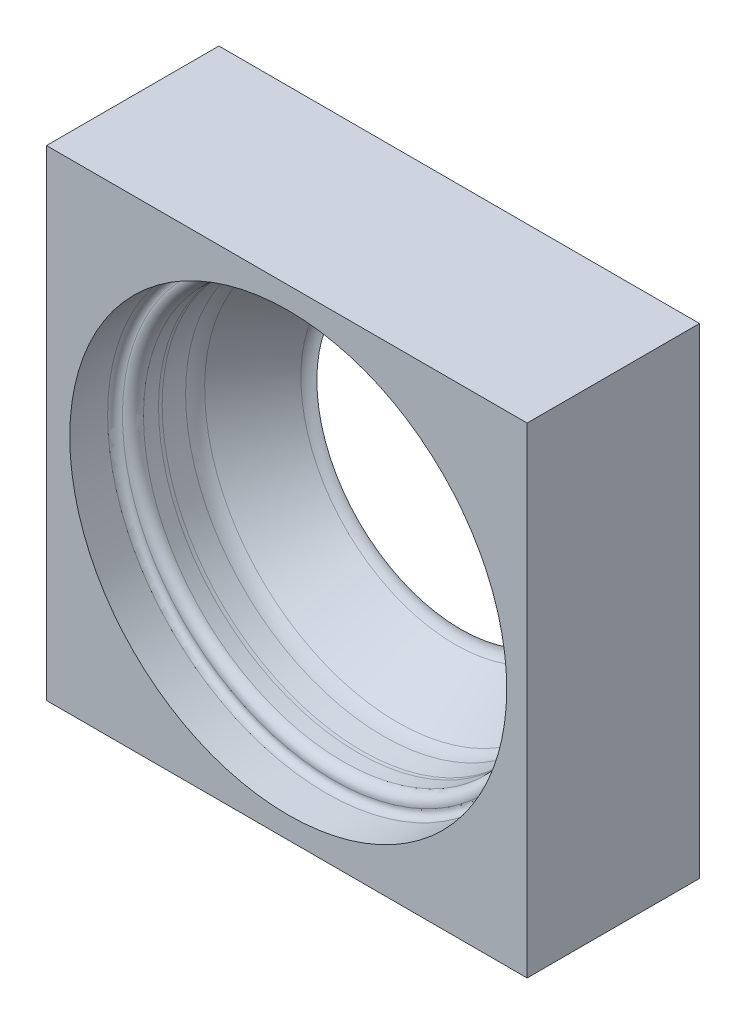
ISO-10303-21;
HEADER;
FILE_DESCRIPTION(('STEP AP214'),'2;1');
FILE_NAME('part.step','',(''),(''),'','','');
FILE_SCHEMA(('AUTOMOTIVE_DESIGN { 1 0 10303 214 1 1 1 1 }'));
ENDSEC;
DATA;
#1=APPLICATION_CONTEXT('core data for automotive mechanical design processes');
#2=APPLICATION_PROTOCOL_DEFINITION('international standard','automotive_design',2000,#1);
#3=PRODUCT_CONTEXT('',#1,'mechanical');
#4=PRODUCT('Part','Part','',(#3));
#5=PRODUCT_RELATED_PRODUCT_CATEGORY('part','',(#4));
#6=PRODUCT_DEFINITION_FORMATION('','',#4);
#7=PRODUCT_DEFINITION_CONTEXT('part definition',#1,'design');
#8=PRODUCT_DEFINITION('design','',#6,#7);
#9=PRODUCT_DEFINITION_SHAPE('','',#8);
#10=(LENGTH_UNIT() NAMED_UNIT(*) SI_UNIT(.MILLI.,.METRE.));
#11=(NAMED_UNIT(*) PLANE_ANGLE_UNIT() SI_UNIT($,.RADIAN.));
#12=(NAMED_UNIT(*) SI_UNIT($,.STERADIAN.) SOLID_ANGLE_UNIT());
#13=UNCERTAINTY_MEASURE_WITH_UNIT(LENGTH_MEASURE(1.E-05),#10,'distance_accuracy_value','');
#14=(GEOMETRIC_REPRESENTATION_CONTEXT(3) GLOBAL_UNCERTAINTY_ASSIGNED_CONTEXT((#13)) GLOBAL_UNIT_ASSIGNED_CONTEXT((#10,
#11,#12)) REPRESENTATION_CONTEXT('',''));
#15=CARTESIAN_POINT('',(0.,0.,0.));
#16=DIRECTION('',(0.,0.,1.));
#17=DIRECTION('',(1.,0.,0.));
#18=AXIS2_PLACEMENT_3D('',#15,#16,#17);
#19=CARTESIAN_POINT('',(0.,-4.61267334725164E-13,127.132943369893));
#20=DIRECTION('',(0.,0.,-1.));
#21=DIRECTION('',(0.,1.,0.));
#22=AXIS2_PLACEMENT_3D('',#19,#20,#21);
#23=PLANE('',#22);
#24=DIRECTION('',(-1.,0.,0.));
#25=VECTOR('',#24,1.);
#26=CARTESIAN_POINT('',(152.4,-152.4,127.132943369892));
#27=LINE('',#26,#25);
#28=CARTESIAN_POINT('',(152.4,-152.4,127.132943369893));
#29=VERTEX_POINT('',#28);
#30=CARTESIAN_POINT('',(-152.4,-152.4,127.132943369892));
#31=VERTEX_POINT('',#30);
#32=EDGE_CURVE('E134',#29,#31,#27,.T.);
#33=ORIENTED_EDGE('',*,*,#32,.T.);
#34=DIRECTION('',(0.,1.,0.));
#35=VECTOR('',#34,1.);
#36=CARTESIAN_POINT('',(-152.4,152.4,127.132943369893));
#37=LINE('',#36,#35);
#38=CARTESIAN_POINT('',(-152.4,152.4,127.132943369893));
#39=VERTEX_POINT('',#38);
#40=EDGE_CURVE('E132',#31,#39,#37,.T.);
#41=ORIENTED_EDGE('',*,*,#40,.T.);
#42=DIRECTION('',(1.,0.,0.));
#43=VECTOR('',#42,1.);
#44=CARTESIAN_POINT('',(152.4,152.4,127.132943369893));
#45=LINE('',#44,#43);
#46=CARTESIAN_POINT('',(152.4,152.4,127.132943369893));
#47=VERTEX_POINT('',#46);
#48=EDGE_CURVE('E87',#39,#47,#45,.T.);
#49=ORIENTED_EDGE('',*,*,#48,.T.);
#50=DIRECTION('',(0.,-1.,0.));
#51=VECTOR('',#50,1.);
#52=CARTESIAN_POINT('',(152.4,152.4,127.132943369893));
#53=LINE('',#52,#51);
#54=EDGE_CURVE('E137',#47,#29,#53,.T.);
#55=ORIENTED_EDGE('',*,*,#54,.T.);
#56=EDGE_LOOP('',(#33,#41,#49,#55));
#57=FACE_BOUND('',#56,.T.);
#58=CARTESIAN_POINT('',(0.90869526163995,-0.0776127525782167,127.132943369893));
#59=DIRECTION('',(0.,0.,1.));
#60=DIRECTION('',(0.,-1.,0.));
#61=AXIS2_PLACEMENT_3D('',#58,#59,#60);
#62=CIRCLE('',#61,91.1860000000005);
#63=CARTESIAN_POINT('',(0.90869526163995,-91.2636127525787,127.132943369892));
#64=VERTEX_POINT('',#63);
#65=EDGE_CURVE('E11',#64,#64,#62,.T.);
#66=ORIENTED_EDGE('',*,*,#65,.T.);
#67=EDGE_LOOP('',(#66));
#68=FACE_BOUND('',#67,.T.);
#69=ADVANCED_FACE('F39',(#57,#68),#23,.T.);
#70=CARTESIAN_POINT('',(0.90869526163995,-0.0776127525783632,169.085651996013));
#71=DIRECTION('',(0.,0.,1.));
#72=DIRECTION('',(0.,-1.,0.));
#73=AXIS2_PLACEMENT_3D('',#70,#71,#72);
#74=CYLINDRICAL_SURFACE('',#73,138.555289406168);
#75=CARTESIAN_POINT('',(0.90869526163995,-0.0776127525785146,212.450968055006));
#76=DIRECTION('',(0.,0.,1.));
#77=DIRECTION('',(0.,-1.,0.));
#78=AXIS2_PLACEMENT_3D('',#75,#76,#77);
#79=CIRCLE('',#78,138.555289406168);
#80=CARTESIAN_POINT('',(0.90869526163995,-138.632902158747,212.450968055005));
#81=VERTEX_POINT('',#80);
#82=EDGE_CURVE('E90',#81,#81,#79,.T.);
#83=ORIENTED_EDGE('',*,*,#82,.F.);
#84=EDGE_LOOP('',(#83));
#85=FACE_BOUND('',#84,.T.);
#86=CARTESIAN_POINT('',(0.90869526163995,-0.0776127525785565,236.450968055006));
#87=DIRECTION('',(0.,0.,1.));
#88=DIRECTION('',(1.,0.,0.));
#89=AXIS2_PLACEMENT_3D('',#86,#87,#88);
#90=CIRCLE('',#89,138.555289406168);
#91=CARTESIAN_POINT('',(139.463984667808,-0.0776127525785565,236.450968055006));
#92=VERTEX_POINT('',#91);
#93=EDGE_CURVE('E103',#92,#92,#90,.T.);
#94=ORIENTED_EDGE('',*,*,#93,.T.);
#95=EDGE_LOOP('',(#94));
#96=FACE_BOUND('',#95,.T.);
#97=ADVANCED_FACE('F155',(#85,#96),#74,.F.);
#98=CARTESIAN_POINT('',(0.90869526163995,-0.0776127525785141,212.327662527832));
#99=DIRECTION('',(0.,0.,1.));
#100=DIRECTION('',(0.,-1.,0.));
#101=AXIS2_PLACEMENT_3D('',#98,#99,#100);
#102=TOROIDAL_SURFACE('',#101,134.112,4.44499999999991);
#103=CARTESIAN_POINT('',(0.90869526163995,-0.0776127525784987,207.904943369893));
#104=DIRECTION('',(0.,0.,1.));
#105=DIRECTION('',(0.,-1.,0.));
#106=AXIS2_PLACEMENT_3D('',#103,#104,#105);
#107=CIRCLE('',#106,133.667500000001);
#108=CARTESIAN_POINT('',(0.90869526163995,-133.745112752579,207.904943369892));
#109=VERTEX_POINT('',#108);
#110=EDGE_CURVE('E112',#109,#109,#107,.T.);
#111=ORIENTED_EDGE('',*,*,#110,.F.);
#112=EDGE_LOOP('',(#111));
#113=FACE_BOUND('',#112,.T.);
#114=ORIENTED_EDGE('',*,*,#82,.T.);
#115=EDGE_LOOP('',(#114));
#116=FACE_BOUND('',#115,.T.);
#117=ADVANCED_FACE('F157',(#113,#116),#102,.F.);
#118=CARTESIAN_POINT('',(0.90869526163995,-0.0776127525784766,201.586773144266));
#119=DIRECTION('',(0.,0.,1.));
#120=DIRECTION('',(0.,-1.,0.));
#121=AXIS2_PLACEMENT_3D('',#118,#119,#120);
#122=TOROIDAL_SURFACE('',#121,133.0325,6.34999999999996);
#123=ORIENTED_EDGE('',*,*,#110,.T.);
#124=EDGE_LOOP('',(#123));
#125=FACE_BOUND('',#124,.T.);
#126=CARTESIAN_POINT('',(0.90869526163995,-0.0776127525784766,201.586773144266));
#127=DIRECTION('',(0.,0.,1.));
#128=DIRECTION('',(0.,-1.,0.));
#129=AXIS2_PLACEMENT_3D('',#126,#127,#128);
#130=CIRCLE('',#129,126.6825);
#131=CARTESIAN_POINT('',(0.90869526163995,-126.760112752579,201.586773144265));
#132=VERTEX_POINT('',#131);
#133=EDGE_CURVE('E115',#132,#132,#130,.T.);
#134=ORIENTED_EDGE('',*,*,#133,.F.);
#135=EDGE_LOOP('',(#134));
#136=FACE_BOUND('',#135,.T.);
#137=ADVANCED_FACE('F164',(#125,#136),#122,.T.);
#138=CARTESIAN_POINT('',(0.90869526163995,-0.0776127525783632,169.085651996013));
#139=DIRECTION('',(0.,0.,1.));
#140=DIRECTION('',(0.,-1.,0.));
#141=AXIS2_PLACEMENT_3D('',#138,#139,#140);
#142=CYLINDRICAL_SURFACE('',#141,126.6825);
#143=CARTESIAN_POINT('',(0.90869526163995,-0.0776127525784433,192.029943369893));
#144=DIRECTION('',(0.,0.,1.));
#145=DIRECTION('',(0.,-1.,0.));
#146=AXIS2_PLACEMENT_3D('',#143,#144,#145);
#147=CIRCLE('',#146,126.6825);
#148=CARTESIAN_POINT('',(0.90869526163995,-126.760112752578,192.029943369892));
#149=VERTEX_POINT('',#148);
#150=EDGE_CURVE('E118',#149,#149,#147,.T.);
#151=ORIENTED_EDGE('',*,*,#150,.F.);
#152=EDGE_LOOP('',(#151));
#153=FACE_BOUND('',#152,.T.);
#154=ORIENTED_EDGE('',*,*,#133,.T.);
#155=EDGE_LOOP('',(#154));
#156=FACE_BOUND('',#155,.T.);
#157=ADVANCED_FACE('F174',(#153,#156),#142,.F.);
#158=CARTESIAN_POINT('',(0.90869526163995,-0.0776127525784433,192.029943369893));
#159=DIRECTION('',(0.,0.,1.));
#160=DIRECTION('',(0.,-1.,0.));
#161=AXIS2_PLACEMENT_3D('',#158,#159,#160);
#162=TOROIDAL_SURFACE('',#161,101.2825,25.3999999999999);
#163=CARTESIAN_POINT('',(0.90869526163995,-0.0776127525784355,189.816187504102));
#164=DIRECTION('',(0.,0.,1.));
#165=DIRECTION('',(0.,-1.,0.));
#166=AXIS2_PLACEMENT_3D('',#163,#164,#165);
#167=CIRCLE('',#166,126.58584533153);
#168=CARTESIAN_POINT('',(0.90869526163995,-126.663458084109,189.816187504102));
#169=VERTEX_POINT('',#168);
#170=EDGE_CURVE('E121',#169,#169,#167,.T.);
#171=ORIENTED_EDGE('',*,*,#170,.F.);
#172=EDGE_LOOP('',(#171));
#173=FACE_BOUND('',#172,.T.);
#174=ORIENTED_EDGE('',*,*,#150,.T.);
#175=EDGE_LOOP('',(#174));
#176=FACE_BOUND('',#175,.T.);
#177=ADVANCED_FACE('F178',(#173,#176),#162,.F.);
#178=CARTESIAN_POINT('',(0.90869526163995,-0.0776127525784355,189.816187504102));
#179=DIRECTION('',(0.,0.,1.));
#180=DIRECTION('',(0.,-1.,0.));
#181=AXIS2_PLACEMENT_3D('',#178,#179,#180);
#182=CONICAL_SURFACE('',#181,126.58584533153,0.0872664625997177);
#183=CARTESIAN_POINT('',(0.90869526163995,-0.0776127525783878,176.154943369893));
#184=DIRECTION('',(0.,0.,1.));
#185=DIRECTION('',(0.,-1.,0.));
#186=AXIS2_PLACEMENT_3D('',#183,#184,#185);
#187=CIRCLE('',#186,125.390641340127);
#188=CARTESIAN_POINT('',(0.90869526163995,-125.468254092705,176.154943369892));
#189=VERTEX_POINT('',#188);
#190=EDGE_CURVE('E124',#189,#189,#187,.T.);
#191=ORIENTED_EDGE('',*,*,#190,.F.);
#192=EDGE_LOOP('',(#191));
#193=FACE_BOUND('',#192,.T.);
#194=ORIENTED_EDGE('',*,*,#170,.T.);
#195=EDGE_LOOP('',(#194));
#196=FACE_BOUND('',#195,.T.);
#197=ADVANCED_FACE('F182',(#193,#196),#182,.F.);
#198=CARTESIAN_POINT('',(0.90869526163995,-0.0776127525783936,177.815260269235));
#199=DIRECTION('',(0.,0.,1.));
#200=DIRECTION('',(0.,-1.,0.));
#201=AXIS2_PLACEMENT_3D('',#198,#199,#200);
#202=TOROIDAL_SURFACE('',#201,106.413132341479,19.05);
#203=CARTESIAN_POINT('',(0.90869526163995,-0.0776127525783566,167.222414925144));
#204=DIRECTION('',(0.,0.,1.));
#205=DIRECTION('',(0.,-1.,0.));
#206=AXIS2_PLACEMENT_3D('',#203,#204,#205);
#207=CIRCLE('',#206,122.246455666548);
#208=CARTESIAN_POINT('',(0.90869526163995,-122.324068419126,167.222414925144));
#209=VERTEX_POINT('',#208);
#210=EDGE_CURVE('E127',#209,#209,#207,.T.);
#211=ORIENTED_EDGE('',*,*,#210,.F.);
#212=EDGE_LOOP('',(#211));
#213=FACE_BOUND('',#212,.T.);
#214=ORIENTED_EDGE('',*,*,#190,.T.);
#215=EDGE_LOOP('',(#214));
#216=FACE_BOUND('',#215,.T.);
#217=ADVANCED_FACE('F186',(#213,#216),#202,.F.);
#218=CARTESIAN_POINT('',(0.90869526163995,-0.0776127525783566,167.222414925144));
#219=DIRECTION('',(0.,0.,1.));
#220=DIRECTION('',(0.,-1.,0.));
#221=AXIS2_PLACEMENT_3D('',#218,#219,#220);
#222=CONICAL_SURFACE('',#221,122.246455666548,0.58963160852596);
#223=CARTESIAN_POINT('',(0.90869526163995,-0.077612752578229,130.656757809854));
#224=DIRECTION('',(0.,0.,1.));
#225=DIRECTION('',(0.,-1.,0.));
#226=AXIS2_PLACEMENT_3D('',#223,#224,#225);
#227=CIRCLE('',#226,97.7832180521123);
#228=CARTESIAN_POINT('',(0.90869526163995,-97.8608308046906,130.656757809854));
#229=VERTEX_POINT('',#228);
#230=EDGE_CURVE('E48',#229,#229,#227,.T.);
#231=ORIENTED_EDGE('',*,*,#230,.F.);
#232=EDGE_LOOP('',(#231));
#233=FACE_BOUND('',#232,.T.);
#234=ORIENTED_EDGE('',*,*,#210,.T.);
#235=EDGE_LOOP('',(#234));
#236=FACE_BOUND('',#235,.T.);
#237=ADVANCED_FACE('F190',(#233,#236),#222,.F.);
#238=CARTESIAN_POINT('',(0.90869526163995,-0.0776127525782444,135.070443369893));
#239=DIRECTION('',(0.,0.,1.));
#240=DIRECTION('',(0.,-1.,0.));
#241=AXIS2_PLACEMENT_3D('',#238,#239,#240);
#242=TOROIDAL_SURFACE('',#241,91.1860000000004,7.93750000000004);
#243=ORIENTED_EDGE('',*,*,#65,.F.);
#244=EDGE_LOOP('',(#243));
#245=FACE_BOUND('',#244,.T.);
#246=ORIENTED_EDGE('',*,*,#230,.T.);
#247=EDGE_LOOP('',(#246));
#248=FACE_BOUND('',#247,.T.);
#249=ADVANCED_FACE('F153',(#245,#248),#242,.F.);
#250=CARTESIAN_POINT('',(-152.4,152.4,228.6));
#251=DIRECTION('',(1.,0.,0.));
#252=DIRECTION('',(0.,1.,0.));
#253=AXIS2_PLACEMENT_3D('',#250,#251,#252);
#254=PLANE('',#253);
#255=DIRECTION('',(0.,0.,-1.));
#256=VECTOR('',#255,1.);
#257=CARTESIAN_POINT('',(-152.4,-152.4,228.6));
#258=LINE('',#257,#256);
#259=CARTESIAN_POINT('',(-152.4,-152.4,236.450968055006));
#260=VERTEX_POINT('',#259);
#261=EDGE_CURVE('E56',#260,#31,#258,.T.);
#262=ORIENTED_EDGE('',*,*,#261,.F.);
#263=DIRECTION('',(0.,-1.,0.));
#264=VECTOR('',#263,1.);
#265=CARTESIAN_POINT('',(-152.4,152.4,236.450968055006));
#266=LINE('',#265,#264);
#267=CARTESIAN_POINT('',(-152.4,152.4,236.450968055006));
#268=VERTEX_POINT('',#267);
#269=EDGE_CURVE('E93',#268,#260,#266,.T.);
#270=ORIENTED_EDGE('',*,*,#269,.F.);
#271=DIRECTION('',(0.,0.,-1.));
#272=VECTOR('',#271,1.);
#273=CARTESIAN_POINT('',(-152.4,152.4,228.6));
#274=LINE('',#273,#272);
#275=EDGE_CURVE('E43',#268,#39,#274,.T.);
#276=ORIENTED_EDGE('',*,*,#275,.T.);
#277=ORIENTED_EDGE('',*,*,#40,.F.);
#278=EDGE_LOOP('',(#262,#270,#276,#277));
#279=FACE_BOUND('',#278,.T.);
#280=ADVANCED_FACE('F94',(#279),#254,.F.);
#281=CARTESIAN_POINT('',(152.4,-152.4,228.6));
#282=DIRECTION('',(0.,1.,0.));
#283=DIRECTION('',(-1.,0.,0.));
#284=AXIS2_PLACEMENT_3D('',#281,#282,#283);
#285=PLANE('',#284);
#286=DIRECTION('',(0.,0.,-1.));
#287=VECTOR('',#286,1.);
#288=CARTESIAN_POINT('',(152.4,-152.4,228.6));
#289=LINE('',#288,#287);
#290=CARTESIAN_POINT('',(152.4,-152.4,236.450968055006));
#291=VERTEX_POINT('',#290);
#292=EDGE_CURVE('E64',#291,#29,#289,.T.);
#293=ORIENTED_EDGE('',*,*,#292,.F.);
#294=DIRECTION('',(1.,0.,0.));
#295=VECTOR('',#294,1.);
#296=CARTESIAN_POINT('',(-152.4,-152.4,236.450968055006));
#297=LINE('',#296,#295);
#298=EDGE_CURVE('E97',#260,#291,#297,.T.);
#299=ORIENTED_EDGE('',*,*,#298,.F.);
#300=ORIENTED_EDGE('',*,*,#261,.T.);
#301=ORIENTED_EDGE('',*,*,#32,.F.);
#302=EDGE_LOOP('',(#293,#299,#300,#301));
#303=FACE_BOUND('',#302,.T.);
#304=ADVANCED_FACE('F145',(#303),#285,.F.);
#305=CARTESIAN_POINT('',(152.4,152.4,228.6));
#306=DIRECTION('',(-1.,0.,0.));
#307=DIRECTION('',(0.,-1.,0.));
#308=AXIS2_PLACEMENT_3D('',#305,#306,#307);
#309=PLANE('',#308);
#310=DIRECTION('',(0.,0.,-1.));
#311=VECTOR('',#310,1.);
#312=CARTESIAN_POINT('',(152.4,152.4,228.6));
#313=LINE('',#312,#311);
#314=CARTESIAN_POINT('',(152.4,152.4,236.450968055006));
#315=VERTEX_POINT('',#314);
#316=EDGE_CURVE('E91',#315,#47,#313,.T.);
#317=ORIENTED_EDGE('',*,*,#316,.F.);
#318=DIRECTION('',(0.,1.,0.));
#319=VECTOR('',#318,1.);
#320=CARTESIAN_POINT('',(152.4,-152.4,236.450968055006));
#321=LINE('',#320,#319);
#322=EDGE_CURVE('E102',#291,#315,#321,.T.);
#323=ORIENTED_EDGE('',*,*,#322,.F.);
#324=ORIENTED_EDGE('',*,*,#292,.T.);
#325=ORIENTED_EDGE('',*,*,#54,.F.);
#326=EDGE_LOOP('',(#317,#323,#324,#325));
#327=FACE_BOUND('',#326,.T.);
#328=ADVANCED_FACE('F142',(#327),#309,.F.);
#329=CARTESIAN_POINT('',(152.4,152.4,228.6));
#330=DIRECTION('',(0.,-1.,0.));
#331=DIRECTION('',(1.,0.,0.));
#332=AXIS2_PLACEMENT_3D('',#329,#330,#331);
#333=PLANE('',#332);
#334=ORIENTED_EDGE('',*,*,#275,.F.);
#335=DIRECTION('',(-1.,0.,0.));
#336=VECTOR('',#335,1.);
#337=CARTESIAN_POINT('',(152.4,152.4,236.450968055006));
#338=LINE('',#337,#336);
#339=EDGE_CURVE('E85',#315,#268,#338,.T.);
#340=ORIENTED_EDGE('',*,*,#339,.F.);
#341=ORIENTED_EDGE('',*,*,#316,.T.);
#342=ORIENTED_EDGE('',*,*,#48,.F.);
#343=EDGE_LOOP('',(#334,#340,#341,#342));
#344=FACE_BOUND('',#343,.T.);
#345=ADVANCED_FACE('F41',(#344),#333,.F.);
#346=CARTESIAN_POINT('',(0.,0.,236.450968055006));
#347=DIRECTION('',(0.,0.,1.));
#348=DIRECTION('',(1.,0.,0.));
#349=AXIS2_PLACEMENT_3D('',#346,#347,#348);
#350=PLANE('',#349);
#351=ORIENTED_EDGE('',*,*,#339,.T.);
#352=ORIENTED_EDGE('',*,*,#269,.T.);
#353=ORIENTED_EDGE('',*,*,#298,.T.);
#354=ORIENTED_EDGE('',*,*,#322,.T.);
#355=EDGE_LOOP('',(#351,#352,#353,#354));
#356=FACE_BOUND('',#355,.T.);
#357=ORIENTED_EDGE('',*,*,#93,.F.);
#358=EDGE_LOOP('',(#357));
#359=FACE_BOUND('',#358,.T.);
#360=ADVANCED_FACE('F100',(#356,#359),#350,.T.);
#361=CLOSED_SHELL('',(#69,#97,#117,#137,#157,#177,#197,#217,#237,#249,#280,#304,#328,#345,#360));
#362=MANIFOLD_SOLID_BREP('B2',#361);
#363=ADVANCED_BREP_SHAPE_REPRESENTATION('',(#18,#362),#14);
#364=SHAPE_DEFINITION_REPRESENTATION(#9,#363);
ENDSEC;
END-ISO-10303-21;
